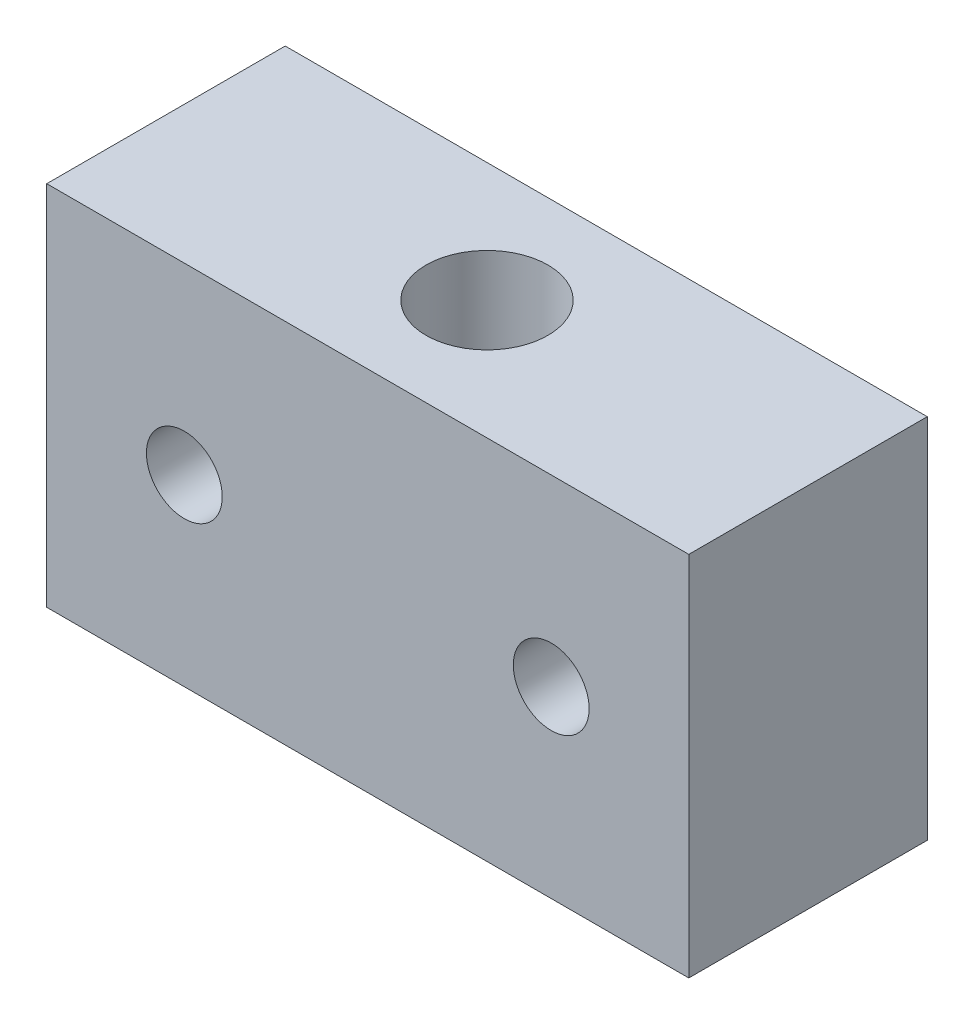
ISO-10303-21;
HEADER;
FILE_DESCRIPTION(('STEP AP214'),'2;1');
FILE_NAME('part.step','',(''),(''),'','','');
FILE_SCHEMA(('AUTOMOTIVE_DESIGN { 1 0 10303 214 1 1 1 1 }'));
ENDSEC;
DATA;
#1=APPLICATION_CONTEXT('core data for automotive mechanical design processes');
#2=APPLICATION_PROTOCOL_DEFINITION('international standard','automotive_design',2000,#1);
#3=PRODUCT_CONTEXT('',#1,'mechanical');
#4=PRODUCT('Part','Part','',(#3));
#5=PRODUCT_RELATED_PRODUCT_CATEGORY('part','',(#4));
#6=PRODUCT_DEFINITION_FORMATION('','',#4);
#7=PRODUCT_DEFINITION_CONTEXT('part definition',#1,'design');
#8=PRODUCT_DEFINITION('design','',#6,#7);
#9=PRODUCT_DEFINITION_SHAPE('','',#8);
#10=(LENGTH_UNIT() NAMED_UNIT(*) SI_UNIT(.MILLI.,.METRE.));
#11=(NAMED_UNIT(*) PLANE_ANGLE_UNIT() SI_UNIT($,.RADIAN.));
#12=(NAMED_UNIT(*) SI_UNIT($,.STERADIAN.) SOLID_ANGLE_UNIT());
#13=UNCERTAINTY_MEASURE_WITH_UNIT(LENGTH_MEASURE(1.E-05),#10,'distance_accuracy_value','');
#14=(GEOMETRIC_REPRESENTATION_CONTEXT(3) GLOBAL_UNCERTAINTY_ASSIGNED_CONTEXT((#13)) GLOBAL_UNIT_ASSIGNED_CONTEXT((#10,
#11,#12)) REPRESENTATION_CONTEXT('',''));
#15=CARTESIAN_POINT('',(0.,0.,0.));
#16=DIRECTION('',(0.,0.,1.));
#17=DIRECTION('',(1.,0.,0.));
#18=AXIS2_PLACEMENT_3D('',#15,#16,#17);
#19=CARTESIAN_POINT('',(0.,-32.3556371690948,6.5));
#20=DIRECTION('',(0.,1.,0.));
#21=DIRECTION('',(-1.,0.,0.));
#22=AXIS2_PLACEMENT_3D('',#19,#20,#21);
#23=CYLINDRICAL_SURFACE('',#22,3.3235);
#24=CARTESIAN_POINT('',(0.,9.99999999999999,6.5));
#25=DIRECTION('',(0.,1.,0.));
#26=DIRECTION('',(-1.,0.,0.));
#27=AXIS2_PLACEMENT_3D('',#24,#25,#26);
#28=CIRCLE('',#27,3.3235);
#29=CARTESIAN_POINT('',(-3.3235,9.99999999999999,6.5));
#30=VERTEX_POINT('',#29);
#31=EDGE_CURVE('E68',#30,#30,#28,.F.);
#32=ORIENTED_EDGE('',*,*,#31,.F.);
#33=EDGE_LOOP('',(#32));
#34=FACE_BOUND('',#33,.T.);
#35=CARTESIAN_POINT('',(0.,-10.,6.5));
#36=DIRECTION('',(0.,1.,0.));
#37=DIRECTION('',(-1.,0.,0.));
#38=AXIS2_PLACEMENT_3D('',#35,#36,#37);
#39=CIRCLE('',#38,3.3235);
#40=CARTESIAN_POINT('',(-3.3235,-10.,6.5));
#41=VERTEX_POINT('',#40);
#42=EDGE_CURVE('E94',#41,#41,#39,.T.);
#43=ORIENTED_EDGE('',*,*,#42,.F.);
#44=EDGE_LOOP('',(#43));
#45=FACE_BOUND('',#44,.T.);
#46=ADVANCED_FACE('F16',(#34,#45),#23,.F.);
#47=CARTESIAN_POINT('',(0.,0.,0.));
#48=DIRECTION('',(0.,0.,1.));
#49=DIRECTION('',(1.,0.,0.));
#50=AXIS2_PLACEMENT_3D('',#47,#48,#49);
#51=PLANE('',#50);
#52=DIRECTION('',(0.,1.,0.));
#53=VECTOR('',#52,1.);
#54=CARTESIAN_POINT('',(17.5,9.99999999999999,0.));
#55=LINE('',#54,#53);
#56=CARTESIAN_POINT('',(17.5,-10.,0.));
#57=VERTEX_POINT('',#56);
#58=CARTESIAN_POINT('',(17.5,9.99999999999999,0.));
#59=VERTEX_POINT('',#58);
#60=EDGE_CURVE('E59',#57,#59,#55,.T.);
#61=ORIENTED_EDGE('',*,*,#60,.F.);
#62=DIRECTION('',(1.,0.,0.));
#63=VECTOR('',#62,1.);
#64=CARTESIAN_POINT('',(17.5,-10.,0.));
#65=LINE('',#64,#63);
#66=CARTESIAN_POINT('',(-17.5,-10.,0.));
#67=VERTEX_POINT('',#66);
#68=EDGE_CURVE('E233',#67,#57,#65,.T.);
#69=ORIENTED_EDGE('',*,*,#68,.F.);
#70=DIRECTION('',(0.,1.,0.));
#71=VECTOR('',#70,1.);
#72=CARTESIAN_POINT('',(-17.5,-10.,0.));
#73=LINE('',#72,#71);
#74=CARTESIAN_POINT('',(-17.5,10.,0.));
#75=VERTEX_POINT('',#74);
#76=EDGE_CURVE('E73',#75,#67,#73,.F.);
#77=ORIENTED_EDGE('',*,*,#76,.F.);
#78=DIRECTION('',(-1.,0.,0.));
#79=VECTOR('',#78,1.);
#80=CARTESIAN_POINT('',(-17.5,10.,0.));
#81=LINE('',#80,#79);
#82=EDGE_CURVE('E54',#59,#75,#81,.T.);
#83=ORIENTED_EDGE('',*,*,#82,.F.);
#84=EDGE_LOOP('',(#61,#69,#77,#83));
#85=FACE_BOUND('',#84,.T.);
#86=CARTESIAN_POINT('',(-10.,0.,0.));
#87=DIRECTION('',(0.,0.,1.));
#88=DIRECTION('',(1.,0.,0.));
#89=AXIS2_PLACEMENT_3D('',#86,#87,#88);
#90=CIRCLE('',#89,2.067);
#91=CARTESIAN_POINT('',(-7.933,0.,0.));
#92=VERTEX_POINT('',#91);
#93=EDGE_CURVE('E69',#92,#92,#90,.T.);
#94=ORIENTED_EDGE('',*,*,#93,.T.);
#95=EDGE_LOOP('',(#94));
#96=FACE_BOUND('',#95,.T.);
#97=CARTESIAN_POINT('',(10.,0.,0.));
#98=DIRECTION('',(0.,0.,1.));
#99=DIRECTION('',(1.,0.,0.));
#100=AXIS2_PLACEMENT_3D('',#97,#98,#99);
#101=CIRCLE('',#100,2.067);
#102=CARTESIAN_POINT('',(12.067,0.,0.));
#103=VERTEX_POINT('',#102);
#104=EDGE_CURVE('E19',#103,#103,#101,.T.);
#105=ORIENTED_EDGE('',*,*,#104,.T.);
#106=EDGE_LOOP('',(#105));
#107=FACE_BOUND('',#106,.T.);
#108=ADVANCED_FACE('F71',(#85,#96,#107),#51,.F.);
#109=CARTESIAN_POINT('',(10.,0.,-29.3556371690948));
#110=DIRECTION('',(0.,0.,1.));
#111=DIRECTION('',(1.,0.,0.));
#112=AXIS2_PLACEMENT_3D('',#109,#110,#111);
#113=CYLINDRICAL_SURFACE('',#112,2.067);
#114=CARTESIAN_POINT('',(10.,0.,13.));
#115=DIRECTION('',(0.,0.,1.));
#116=DIRECTION('',(1.,0.,0.));
#117=AXIS2_PLACEMENT_3D('',#114,#115,#116);
#118=CIRCLE('',#117,2.067);
#119=CARTESIAN_POINT('',(12.067,0.,13.));
#120=VERTEX_POINT('',#119);
#121=EDGE_CURVE('E91',#120,#120,#118,.F.);
#122=ORIENTED_EDGE('',*,*,#121,.F.);
#123=EDGE_LOOP('',(#122));
#124=FACE_BOUND('',#123,.T.);
#125=ORIENTED_EDGE('',*,*,#104,.F.);
#126=EDGE_LOOP('',(#125));
#127=FACE_BOUND('',#126,.T.);
#128=ADVANCED_FACE('F102',(#124,#127),#113,.F.);
#129=CARTESIAN_POINT('',(-10.,0.,-29.3556371690948));
#130=DIRECTION('',(0.,0.,1.));
#131=DIRECTION('',(1.,0.,0.));
#132=AXIS2_PLACEMENT_3D('',#129,#130,#131);
#133=CYLINDRICAL_SURFACE('',#132,2.067);
#134=CARTESIAN_POINT('',(-10.,0.,13.));
#135=DIRECTION('',(0.,0.,1.));
#136=DIRECTION('',(1.,0.,0.));
#137=AXIS2_PLACEMENT_3D('',#134,#135,#136);
#138=CIRCLE('',#137,2.067);
#139=CARTESIAN_POINT('',(-7.933,0.,13.));
#140=VERTEX_POINT('',#139);
#141=EDGE_CURVE('E87',#140,#140,#138,.F.);
#142=ORIENTED_EDGE('',*,*,#141,.F.);
#143=EDGE_LOOP('',(#142));
#144=FACE_BOUND('',#143,.T.);
#145=ORIENTED_EDGE('',*,*,#93,.F.);
#146=EDGE_LOOP('',(#145));
#147=FACE_BOUND('',#146,.T.);
#148=ADVANCED_FACE('F104',(#144,#147),#133,.F.);
#149=CARTESIAN_POINT('',(17.5,9.99999999999999,0.));
#150=DIRECTION('',(1.,0.,0.));
#151=DIRECTION('',(0.,1.,0.));
#152=AXIS2_PLACEMENT_3D('',#149,#150,#151);
#153=PLANE('',#152);
#154=ORIENTED_EDGE('',*,*,#60,.T.);
#155=DIRECTION('',(0.,0.,1.));
#156=VECTOR('',#155,1.);
#157=CARTESIAN_POINT('',(17.5,9.99999999999999,0.));
#158=LINE('',#157,#156);
#159=CARTESIAN_POINT('',(17.5,9.99999999999999,13.));
#160=VERTEX_POINT('',#159);
#161=EDGE_CURVE('E61',#160,#59,#158,.F.);
#162=ORIENTED_EDGE('',*,*,#161,.F.);
#163=DIRECTION('',(0.,1.,0.));
#164=VECTOR('',#163,1.);
#165=CARTESIAN_POINT('',(17.5,0.,13.));
#166=LINE('',#165,#164);
#167=CARTESIAN_POINT('',(17.5,-10.,13.));
#168=VERTEX_POINT('',#167);
#169=EDGE_CURVE('E90',#168,#160,#166,.T.);
#170=ORIENTED_EDGE('',*,*,#169,.F.);
#171=DIRECTION('',(0.,0.,1.));
#172=VECTOR('',#171,1.);
#173=CARTESIAN_POINT('',(17.5,-10.,0.));
#174=LINE('',#173,#172);
#175=EDGE_CURVE('E64',#57,#168,#174,.T.);
#176=ORIENTED_EDGE('',*,*,#175,.F.);
#177=EDGE_LOOP('',(#154,#162,#170,#176));
#178=FACE_BOUND('',#177,.T.);
#179=ADVANCED_FACE('F60',(#178),#153,.T.);
#180=CARTESIAN_POINT('',(-17.5,10.,0.));
#181=DIRECTION('',(0.,1.,0.));
#182=DIRECTION('',(-1.,0.,0.));
#183=AXIS2_PLACEMENT_3D('',#180,#181,#182);
#184=PLANE('',#183);
#185=ORIENTED_EDGE('',*,*,#82,.T.);
#186=DIRECTION('',(0.,0.,1.));
#187=VECTOR('',#186,1.);
#188=CARTESIAN_POINT('',(-17.5,10.,0.));
#189=LINE('',#188,#187);
#190=CARTESIAN_POINT('',(-17.5,10.,13.));
#191=VERTEX_POINT('',#190);
#192=EDGE_CURVE('E75',#191,#75,#189,.F.);
#193=ORIENTED_EDGE('',*,*,#192,.F.);
#194=DIRECTION('',(1.,0.,0.));
#195=VECTOR('',#194,1.);
#196=CARTESIAN_POINT('',(0.,9.99999999999999,13.));
#197=LINE('',#196,#195);
#198=EDGE_CURVE('E80',#160,#191,#197,.F.);
#199=ORIENTED_EDGE('',*,*,#198,.F.);
#200=ORIENTED_EDGE('',*,*,#161,.T.);
#201=EDGE_LOOP('',(#185,#193,#199,#200));
#202=FACE_BOUND('',#201,.T.);
#203=ORIENTED_EDGE('',*,*,#31,.T.);
#204=EDGE_LOOP('',(#203));
#205=FACE_BOUND('',#204,.T.);
#206=ADVANCED_FACE('F77',(#202,#205),#184,.T.);
#207=CARTESIAN_POINT('',(-17.5,-10.,0.));
#208=DIRECTION('',(-1.,0.,0.));
#209=DIRECTION('',(0.,0.,1.));
#210=AXIS2_PLACEMENT_3D('',#207,#208,#209);
#211=PLANE('',#210);
#212=ORIENTED_EDGE('',*,*,#76,.T.);
#213=DIRECTION('',(0.,0.,1.));
#214=VECTOR('',#213,1.);
#215=CARTESIAN_POINT('',(-17.5,-9.99999999999999,0.));
#216=LINE('',#215,#214);
#217=CARTESIAN_POINT('',(-17.5,-10.,13.));
#218=VERTEX_POINT('',#217);
#219=EDGE_CURVE('E34',#218,#67,#216,.F.);
#220=ORIENTED_EDGE('',*,*,#219,.F.);
#221=DIRECTION('',(0.,1.,0.));
#222=VECTOR('',#221,1.);
#223=CARTESIAN_POINT('',(-17.5,0.,13.));
#224=LINE('',#223,#222);
#225=EDGE_CURVE('E25',#191,#218,#224,.F.);
#226=ORIENTED_EDGE('',*,*,#225,.F.);
#227=ORIENTED_EDGE('',*,*,#192,.T.);
#228=EDGE_LOOP('',(#212,#220,#226,#227));
#229=FACE_BOUND('',#228,.T.);
#230=ADVANCED_FACE('F123',(#229),#211,.T.);
#231=CARTESIAN_POINT('',(17.5,-10.,0.));
#232=DIRECTION('',(0.,-1.,0.));
#233=DIRECTION('',(1.,0.,0.));
#234=AXIS2_PLACEMENT_3D('',#231,#232,#233);
#235=PLANE('',#234);
#236=ORIENTED_EDGE('',*,*,#68,.T.);
#237=ORIENTED_EDGE('',*,*,#175,.T.);
#238=DIRECTION('',(1.,0.,0.));
#239=VECTOR('',#238,1.);
#240=CARTESIAN_POINT('',(0.,-10.,13.));
#241=LINE('',#240,#239);
#242=EDGE_CURVE('E11',#218,#168,#241,.T.);
#243=ORIENTED_EDGE('',*,*,#242,.F.);
#244=ORIENTED_EDGE('',*,*,#219,.T.);
#245=EDGE_LOOP('',(#236,#237,#243,#244));
#246=FACE_BOUND('',#245,.T.);
#247=ORIENTED_EDGE('',*,*,#42,.T.);
#248=EDGE_LOOP('',(#247));
#249=FACE_BOUND('',#248,.T.);
#250=ADVANCED_FACE('F117',(#246,#249),#235,.T.);
#251=CARTESIAN_POINT('',(0.,0.,13.));
#252=DIRECTION('',(0.,0.,1.));
#253=DIRECTION('',(1.,0.,0.));
#254=AXIS2_PLACEMENT_3D('',#251,#252,#253);
#255=PLANE('',#254);
#256=ORIENTED_EDGE('',*,*,#225,.T.);
#257=ORIENTED_EDGE('',*,*,#242,.T.);
#258=ORIENTED_EDGE('',*,*,#169,.T.);
#259=ORIENTED_EDGE('',*,*,#198,.T.);
#260=EDGE_LOOP('',(#256,#257,#258,#259));
#261=FACE_BOUND('',#260,.T.);
#262=ORIENTED_EDGE('',*,*,#141,.T.);
#263=EDGE_LOOP('',(#262));
#264=FACE_BOUND('',#263,.T.);
#265=ORIENTED_EDGE('',*,*,#121,.T.);
#266=EDGE_LOOP('',(#265));
#267=FACE_BOUND('',#266,.T.);
#268=ADVANCED_FACE('F115',(#261,#264,#267),#255,.T.);
#269=CLOSED_SHELL('',(#46,#108,#128,#148,#179,#206,#230,#250,#268));
#270=MANIFOLD_SOLID_BREP('B1',#269);
#271=ADVANCED_BREP_SHAPE_REPRESENTATION('',(#18,#270),#14);
#272=SHAPE_DEFINITION_REPRESENTATION(#9,#271);
ENDSEC;
END-ISO-10303-21;
